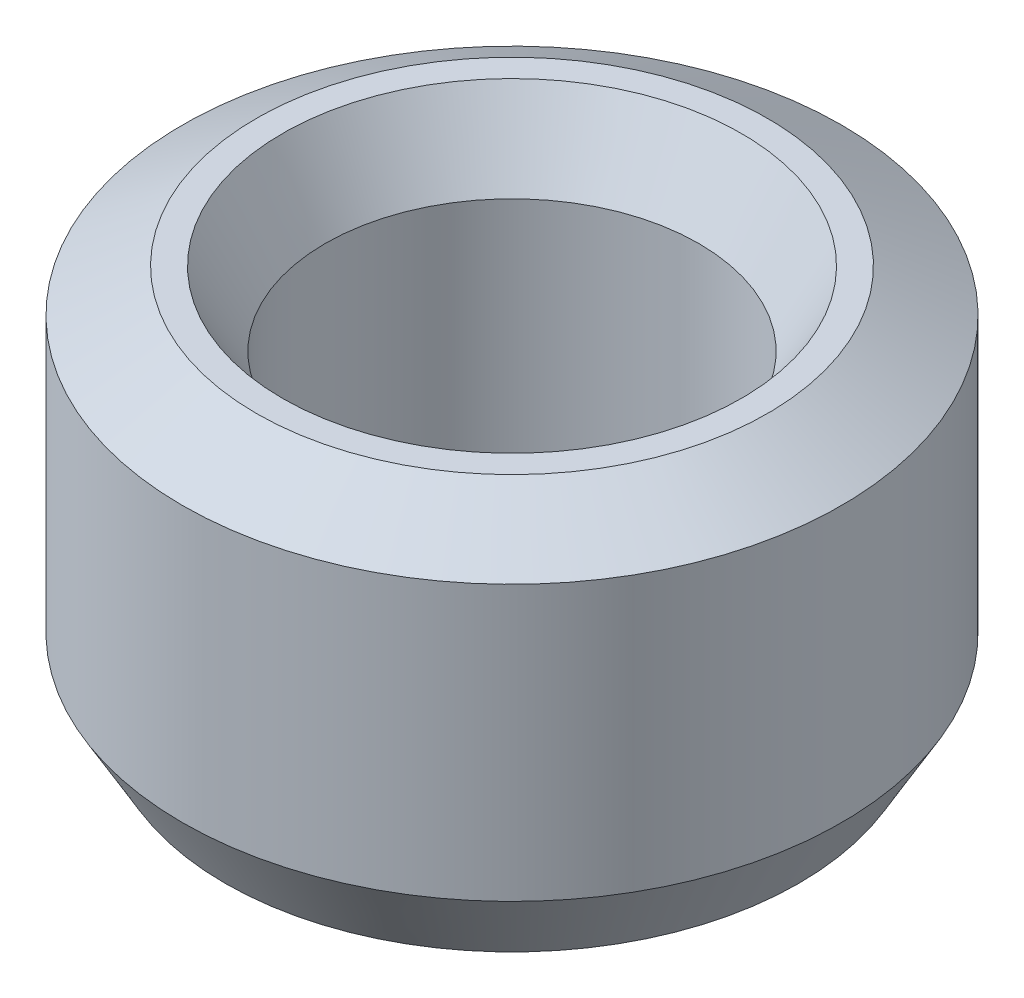
ISO-10303-21;
HEADER;
FILE_DESCRIPTION(('STEP AP214'),'2;1');
FILE_NAME('part.step','',(''),(''),'','','');
FILE_SCHEMA(('AUTOMOTIVE_DESIGN { 1 0 10303 214 1 1 1 1 }'));
ENDSEC;
DATA;
#1=APPLICATION_CONTEXT('core data for automotive mechanical design processes');
#2=APPLICATION_PROTOCOL_DEFINITION('international standard','automotive_design',2000,#1);
#3=PRODUCT_CONTEXT('',#1,'mechanical');
#4=PRODUCT('Part','Part','',(#3));
#5=PRODUCT_RELATED_PRODUCT_CATEGORY('part','',(#4));
#6=PRODUCT_DEFINITION_FORMATION('','',#4);
#7=PRODUCT_DEFINITION_CONTEXT('part definition',#1,'design');
#8=PRODUCT_DEFINITION('design','',#6,#7);
#9=PRODUCT_DEFINITION_SHAPE('','',#8);
#10=(LENGTH_UNIT() NAMED_UNIT(*) SI_UNIT(.MILLI.,.METRE.));
#11=(NAMED_UNIT(*) PLANE_ANGLE_UNIT() SI_UNIT($,.RADIAN.));
#12=(NAMED_UNIT(*) SI_UNIT($,.STERADIAN.) SOLID_ANGLE_UNIT());
#13=UNCERTAINTY_MEASURE_WITH_UNIT(LENGTH_MEASURE(1.E-05),#10,'distance_accuracy_value','');
#14=(GEOMETRIC_REPRESENTATION_CONTEXT(3) GLOBAL_UNCERTAINTY_ASSIGNED_CONTEXT((#13)) GLOBAL_UNIT_ASSIGNED_CONTEXT((#10,
#11,#12)) REPRESENTATION_CONTEXT('',''));
#15=CARTESIAN_POINT('',(0.,0.,0.));
#16=DIRECTION('',(0.,0.,1.));
#17=DIRECTION('',(1.,0.,0.));
#18=AXIS2_PLACEMENT_3D('',#15,#16,#17);
#19=CARTESIAN_POINT('',(0.,20.7791129638924,0.));
#20=DIRECTION('',(0.,-1.,0.));
#21=DIRECTION('',(0.,0.,-1.));
#22=AXIS2_PLACEMENT_3D('',#19,#20,#21);
#23=CYLINDRICAL_SURFACE('',#22,17.5);
#24=CARTESIAN_POINT('',(0.,3.92664293307254,0.));
#25=DIRECTION('',(0.,1.,0.));
#26=DIRECTION('',(0.,0.,1.));
#27=AXIS2_PLACEMENT_3D('',#24,#25,#26);
#28=CIRCLE('',#27,17.5);
#29=CARTESIAN_POINT('',(0.,3.92664293307254,17.5));
#30=VERTEX_POINT('',#29);
#31=EDGE_CURVE('E10',#30,#30,#28,.T.);
#32=ORIENTED_EDGE('',*,*,#31,.T.);
#33=EDGE_LOOP('',(#32));
#34=FACE_BOUND('',#33,.T.);
#35=CARTESIAN_POINT('',(0.,18.5120646094714,0.));
#36=DIRECTION('',(0.,1.,0.));
#37=DIRECTION('',(0.,0.,1.));
#38=AXIS2_PLACEMENT_3D('',#35,#36,#37);
#39=CIRCLE('',#38,17.5);
#40=CARTESIAN_POINT('',(0.,18.5120646094714,17.5));
#41=VERTEX_POINT('',#40);
#42=EDGE_CURVE('E50',#41,#41,#39,.F.);
#43=ORIENTED_EDGE('',*,*,#42,.T.);
#44=EDGE_LOOP('',(#43));
#45=FACE_BOUND('',#44,.T.);
#46=ADVANCED_FACE('F39',(#34,#45),#23,.T.);
#47=CARTESIAN_POINT('',(0.,20.7791129638924,0.));
#48=DIRECTION('',(0.,1.,0.));
#49=DIRECTION('',(0.,0.,1.));
#50=AXIS2_PLACEMENT_3D('',#47,#48,#49);
#51=PLANE('',#50);
#52=CARTESIAN_POINT('',(0.,20.7791129638924,0.));
#53=DIRECTION('',(0.,1.,0.));
#54=DIRECTION('',(0.,0.,1.));
#55=AXIS2_PLACEMENT_3D('',#52,#53,#54);
#56=CIRCLE('',#55,12.1859982866658);
#57=CARTESIAN_POINT('',(0.,20.7791129638924,12.1859982866658));
#58=VERTEX_POINT('',#57);
#59=EDGE_CURVE('E58',#58,#58,#56,.F.);
#60=ORIENTED_EDGE('',*,*,#59,.T.);
#61=EDGE_LOOP('',(#60));
#62=FACE_BOUND('',#61,.T.);
#63=CARTESIAN_POINT('',(0.,20.7791129638924,0.));
#64=DIRECTION('',(0.,1.,0.));
#65=DIRECTION('',(0.,0.,1.));
#66=AXIS2_PLACEMENT_3D('',#63,#64,#65);
#67=CIRCLE('',#66,13.5733570669275);
#68=CARTESIAN_POINT('',(0.,20.7791129638924,13.5733570669275));
#69=VERTEX_POINT('',#68);
#70=EDGE_CURVE('E61',#69,#69,#67,.T.);
#71=ORIENTED_EDGE('',*,*,#70,.T.);
#72=EDGE_LOOP('',(#71));
#73=FACE_BOUND('',#72,.T.);
#74=ADVANCED_FACE('F88',(#62,#73),#51,.T.);
#75=CARTESIAN_POINT('',(0.,0.,0.));
#76=DIRECTION('',(0.,1.,0.));
#77=DIRECTION('',(0.,0.,1.));
#78=AXIS2_PLACEMENT_3D('',#75,#76,#77);
#79=PLANE('',#78);
#80=CARTESIAN_POINT('',(0.,0.,0.));
#81=DIRECTION('',(0.,1.,0.));
#82=DIRECTION('',(0.,0.,1.));
#83=AXIS2_PLACEMENT_3D('',#80,#81,#82);
#84=CIRCLE('',#83,13.8455928653174);
#85=CARTESIAN_POINT('',(0.,0.,13.8455928653174));
#86=VERTEX_POINT('',#85);
#87=EDGE_CURVE('E51',#86,#86,#84,.T.);
#88=ORIENTED_EDGE('',*,*,#87,.T.);
#89=EDGE_LOOP('',(#88));
#90=FACE_BOUND('',#89,.T.);
#91=CARTESIAN_POINT('',(0.,0.,0.));
#92=DIRECTION('',(0.,1.,0.));
#93=DIRECTION('',(0.,0.,1.));
#94=AXIS2_PLACEMENT_3D('',#91,#92,#93);
#95=CIRCLE('',#94,15.232951645579);
#96=CARTESIAN_POINT('',(0.,0.,15.232951645579));
#97=VERTEX_POINT('',#96);
#98=EDGE_CURVE('E54',#97,#97,#95,.F.);
#99=ORIENTED_EDGE('',*,*,#98,.T.);
#100=EDGE_LOOP('',(#99));
#101=FACE_BOUND('',#100,.T.);
#102=ADVANCED_FACE('F83',(#90,#101),#79,.F.);
#103=CARTESIAN_POINT('',(0.,20.7791129638924,0.));
#104=DIRECTION('',(0.,-1.,0.));
#105=DIRECTION('',(0.,0.,-1.));
#106=AXIS2_PLACEMENT_3D('',#103,#104,#105);
#107=CYLINDRICAL_SURFACE('',#106,9.91894993224482);
#108=CARTESIAN_POINT('',(0.,16.8524700308199,0.));
#109=DIRECTION('',(0.,1.,0.));
#110=DIRECTION('',(0.,0.,1.));
#111=AXIS2_PLACEMENT_3D('',#108,#109,#110);
#112=CIRCLE('',#111,9.91894993224482);
#113=CARTESIAN_POINT('',(0.,16.8524700308199,9.91894993224482));
#114=VERTEX_POINT('',#113);
#115=EDGE_CURVE('E67',#114,#114,#112,.T.);
#116=ORIENTED_EDGE('',*,*,#115,.T.);
#117=EDGE_LOOP('',(#116));
#118=FACE_BOUND('',#117,.T.);
#119=CARTESIAN_POINT('',(0.,2.267048354421,0.));
#120=DIRECTION('',(0.,1.,0.));
#121=DIRECTION('',(0.,0.,1.));
#122=AXIS2_PLACEMENT_3D('',#119,#120,#121);
#123=CIRCLE('',#122,9.91894993224482);
#124=CARTESIAN_POINT('',(0.,2.267048354421,9.91894993224482));
#125=VERTEX_POINT('',#124);
#126=EDGE_CURVE('E69',#125,#125,#123,.F.);
#127=ORIENTED_EDGE('',*,*,#126,.T.);
#128=EDGE_LOOP('',(#127));
#129=FACE_BOUND('',#128,.T.);
#130=ADVANCED_FACE('F71',(#118,#129),#107,.F.);
#131=CARTESIAN_POINT('',(0.,16.8524700308199,0.));
#132=DIRECTION('',(0.,1.,0.));
#133=DIRECTION('',(0.,0.,1.));
#134=AXIS2_PLACEMENT_3D('',#131,#132,#133);
#135=CONICAL_SURFACE('',#134,9.91894993224482,0.523598775598302);
#136=ORIENTED_EDGE('',*,*,#59,.F.);
#137=EDGE_LOOP('',(#136));
#138=FACE_BOUND('',#137,.T.);
#139=ORIENTED_EDGE('',*,*,#115,.F.);
#140=EDGE_LOOP('',(#139));
#141=FACE_BOUND('',#140,.T.);
#142=ADVANCED_FACE('F77',(#138,#141),#135,.F.);
#143=CARTESIAN_POINT('',(0.,0.,0.));
#144=DIRECTION('',(0.,-1.,0.));
#145=DIRECTION('',(0.,0.,-1.));
#146=AXIS2_PLACEMENT_3D('',#143,#144,#145);
#147=CONICAL_SURFACE('',#146,13.8455928653174,1.04719755119659);
#148=ORIENTED_EDGE('',*,*,#126,.F.);
#149=EDGE_LOOP('',(#148));
#150=FACE_BOUND('',#149,.T.);
#151=ORIENTED_EDGE('',*,*,#87,.F.);
#152=EDGE_LOOP('',(#151));
#153=FACE_BOUND('',#152,.T.);
#154=ADVANCED_FACE('F73',(#150,#153),#147,.F.);
#155=CARTESIAN_POINT('',(0.,3.92664293307254,0.));
#156=DIRECTION('',(0.,1.,0.));
#157=DIRECTION('',(0.,0.,1.));
#158=AXIS2_PLACEMENT_3D('',#155,#156,#157);
#159=CONICAL_SURFACE('',#158,17.5,0.523598775598302);
#160=ORIENTED_EDGE('',*,*,#98,.F.);
#161=EDGE_LOOP('',(#160));
#162=FACE_BOUND('',#161,.T.);
#163=ORIENTED_EDGE('',*,*,#31,.F.);
#164=EDGE_LOOP('',(#163));
#165=FACE_BOUND('',#164,.T.);
#166=ADVANCED_FACE('F76',(#162,#165),#159,.T.);
#167=CARTESIAN_POINT('',(0.,20.7791129638924,0.));
#168=DIRECTION('',(0.,-1.,0.));
#169=DIRECTION('',(0.,0.,-1.));
#170=AXIS2_PLACEMENT_3D('',#167,#168,#169);
#171=CONICAL_SURFACE('',#170,13.5733570669275,1.04719755119659);
#172=ORIENTED_EDGE('',*,*,#42,.F.);
#173=EDGE_LOOP('',(#172));
#174=FACE_BOUND('',#173,.T.);
#175=ORIENTED_EDGE('',*,*,#70,.F.);
#176=EDGE_LOOP('',(#175));
#177=FACE_BOUND('',#176,.T.);
#178=ADVANCED_FACE('F45',(#174,#177),#171,.T.);
#179=CLOSED_SHELL('',(#46,#74,#102,#130,#142,#154,#166,#178));
#180=MANIFOLD_SOLID_BREP('B2',#179);
#181=ADVANCED_BREP_SHAPE_REPRESENTATION('',(#18,#180),#14);
#182=SHAPE_DEFINITION_REPRESENTATION(#9,#181);
ENDSEC;
END-ISO-10303-21;
